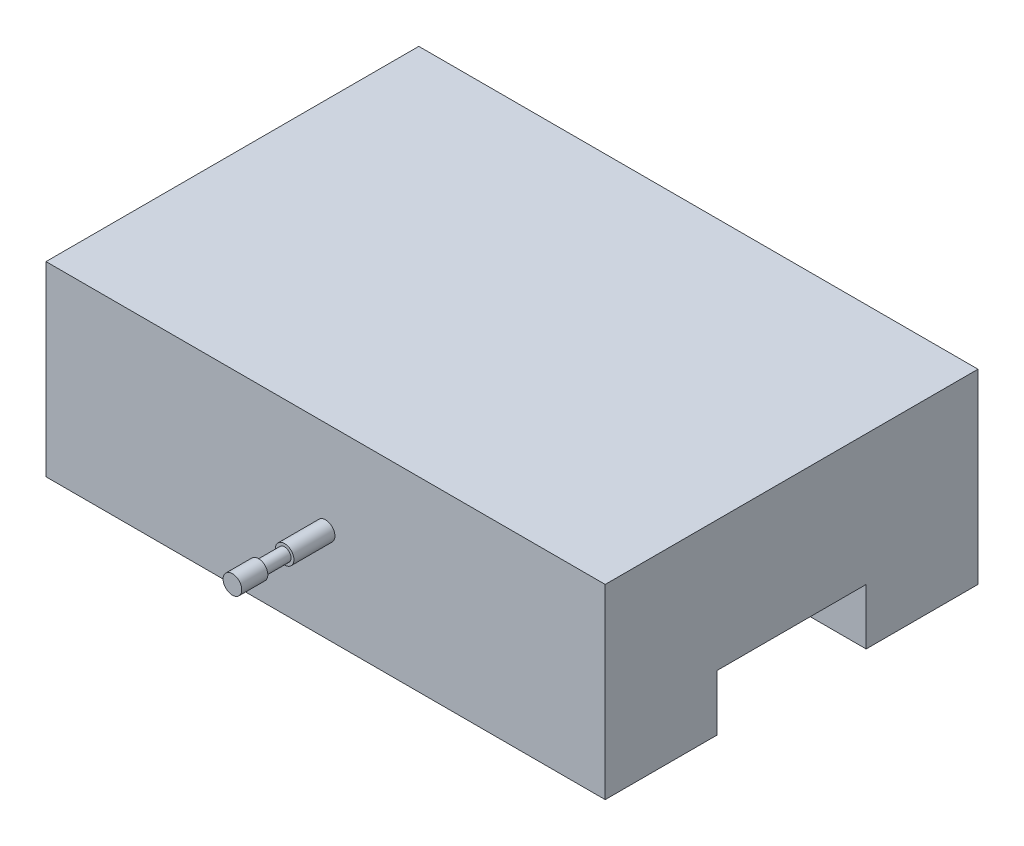
ISO-10303-21;
HEADER;
FILE_DESCRIPTION(('STEP AP214'),'2;1');
FILE_NAME('part.step','',(''),(''),'','','');
FILE_SCHEMA(('AUTOMOTIVE_DESIGN { 1 0 10303 214 1 1 1 1 }'));
ENDSEC;
DATA;
#1=APPLICATION_CONTEXT('core data for automotive mechanical design processes');
#2=APPLICATION_PROTOCOL_DEFINITION('international standard','automotive_design',2000,#1);
#3=PRODUCT_CONTEXT('',#1,'mechanical');
#4=PRODUCT('Part','Part','',(#3));
#5=PRODUCT_RELATED_PRODUCT_CATEGORY('part','',(#4));
#6=PRODUCT_DEFINITION_FORMATION('','',#4);
#7=PRODUCT_DEFINITION_CONTEXT('part definition',#1,'design');
#8=PRODUCT_DEFINITION('design','',#6,#7);
#9=PRODUCT_DEFINITION_SHAPE('','',#8);
#10=(LENGTH_UNIT() NAMED_UNIT(*) SI_UNIT(.MILLI.,.METRE.));
#11=(NAMED_UNIT(*) PLANE_ANGLE_UNIT() SI_UNIT($,.RADIAN.));
#12=(NAMED_UNIT(*) SI_UNIT($,.STERADIAN.) SOLID_ANGLE_UNIT());
#13=UNCERTAINTY_MEASURE_WITH_UNIT(LENGTH_MEASURE(1.E-05),#10,'distance_accuracy_value','');
#14=(GEOMETRIC_REPRESENTATION_CONTEXT(3) GLOBAL_UNCERTAINTY_ASSIGNED_CONTEXT((#13)) GLOBAL_UNIT_ASSIGNED_CONTEXT((#10,
#11,#12)) REPRESENTATION_CONTEXT('',''));
#15=CARTESIAN_POINT('',(0.,0.,0.));
#16=DIRECTION('',(0.,0.,1.));
#17=DIRECTION('',(1.,0.,0.));
#18=AXIS2_PLACEMENT_3D('',#15,#16,#17);
#19=CARTESIAN_POINT('',(-75.,9.99999999999998,75.));
#20=DIRECTION('',(0.,0.,-1.));
#21=DIRECTION('',(-1.,0.,0.));
#22=AXIS2_PLACEMENT_3D('',#19,#20,#21);
#23=CYLINDRICAL_SURFACE('',#22,2.50000000000001);
#24=CARTESIAN_POINT('',(-75.,9.99999999999998,50.));
#25=DIRECTION('',(0.,0.,1.));
#26=DIRECTION('',(1.,0.,0.));
#27=AXIS2_PLACEMENT_3D('',#24,#25,#26);
#28=CIRCLE('',#27,2.50000000000001);
#29=CARTESIAN_POINT('',(-72.5,9.99999999999998,50.));
#30=VERTEX_POINT('',#29);
#31=EDGE_CURVE('E205',#30,#30,#28,.T.);
#32=ORIENTED_EDGE('',*,*,#31,.T.);
#33=EDGE_LOOP('',(#32));
#34=FACE_BOUND('',#33,.T.);
#35=CARTESIAN_POINT('',(-75.,9.99999999999998,61.));
#36=DIRECTION('',(0.,0.,1.));
#37=DIRECTION('',(1.,0.,0.));
#38=AXIS2_PLACEMENT_3D('',#35,#36,#37);
#39=CIRCLE('',#38,2.50000000000001);
#40=CARTESIAN_POINT('',(-72.5,9.99999999999998,61.));
#41=VERTEX_POINT('',#40);
#42=EDGE_CURVE('E207',#41,#41,#39,.T.);
#43=ORIENTED_EDGE('',*,*,#42,.F.);
#44=EDGE_LOOP('',(#43));
#45=FACE_BOUND('',#44,.T.);
#46=ADVANCED_FACE('F37',(#34,#45),#23,.T.);
#47=CARTESIAN_POINT('',(-150.,35.,50.));
#48=DIRECTION('',(0.,0.,1.));
#49=DIRECTION('',(0.,-1.,0.));
#50=AXIS2_PLACEMENT_3D('',#47,#48,#49);
#51=PLANE('',#50);
#52=ORIENTED_EDGE('',*,*,#31,.F.);
#53=EDGE_LOOP('',(#52));
#54=FACE_BOUND('',#53,.T.);
#55=DIRECTION('',(0.,-1.,0.));
#56=VECTOR('',#55,1.);
#57=CARTESIAN_POINT('',(0.,35.,50.));
#58=LINE('',#57,#56);
#59=CARTESIAN_POINT('',(0.,35.,50.));
#60=VERTEX_POINT('',#59);
#61=CARTESIAN_POINT('',(0.,-15.,50.));
#62=VERTEX_POINT('',#61);
#63=EDGE_CURVE('E135',#60,#62,#58,.T.);
#64=ORIENTED_EDGE('',*,*,#63,.F.);
#65=DIRECTION('',(1.,0.,0.));
#66=VECTOR('',#65,1.);
#67=CARTESIAN_POINT('',(-150.,35.,50.));
#68=LINE('',#67,#66);
#69=CARTESIAN_POINT('',(-150.,35.,50.));
#70=VERTEX_POINT('',#69);
#71=EDGE_CURVE('E11',#70,#60,#68,.T.);
#72=ORIENTED_EDGE('',*,*,#71,.F.);
#73=DIRECTION('',(0.,-1.,0.));
#74=VECTOR('',#73,1.);
#75=CARTESIAN_POINT('',(-150.,35.,50.));
#76=LINE('',#75,#74);
#77=CARTESIAN_POINT('',(-150.,-15.,50.));
#78=VERTEX_POINT('',#77);
#79=EDGE_CURVE('E156',#70,#78,#76,.T.);
#80=ORIENTED_EDGE('',*,*,#79,.T.);
#81=DIRECTION('',(1.,0.,0.));
#82=VECTOR('',#81,1.);
#83=CARTESIAN_POINT('',(-150.,-15.,50.));
#84=LINE('',#83,#82);
#85=EDGE_CURVE('E41',#78,#62,#84,.T.);
#86=ORIENTED_EDGE('',*,*,#85,.T.);
#87=EDGE_LOOP('',(#64,#72,#80,#86));
#88=FACE_BOUND('',#87,.T.);
#89=ADVANCED_FACE('F39',(#54,#88),#51,.T.);
#90=CARTESIAN_POINT('',(-150.,35.,50.));
#91=DIRECTION('',(0.,1.,0.));
#92=DIRECTION('',(0.,0.,1.));
#93=AXIS2_PLACEMENT_3D('',#90,#91,#92);
#94=PLANE('',#93);
#95=DIRECTION('',(0.,0.,1.));
#96=VECTOR('',#95,1.);
#97=CARTESIAN_POINT('',(0.,35.,50.));
#98=LINE('',#97,#96);
#99=CARTESIAN_POINT('',(0.,35.,-50.));
#100=VERTEX_POINT('',#99);
#101=EDGE_CURVE('E154',#100,#60,#98,.T.);
#102=ORIENTED_EDGE('',*,*,#101,.F.);
#103=DIRECTION('',(1.,0.,0.));
#104=VECTOR('',#103,1.);
#105=CARTESIAN_POINT('',(-150.,35.,-50.));
#106=LINE('',#105,#104);
#107=CARTESIAN_POINT('',(-150.,35.,-50.));
#108=VERTEX_POINT('',#107);
#109=EDGE_CURVE('E47',#108,#100,#106,.T.);
#110=ORIENTED_EDGE('',*,*,#109,.F.);
#111=DIRECTION('',(0.,0.,1.));
#112=VECTOR('',#111,1.);
#113=CARTESIAN_POINT('',(-150.,35.,50.));
#114=LINE('',#113,#112);
#115=EDGE_CURVE('E125',#108,#70,#114,.T.);
#116=ORIENTED_EDGE('',*,*,#115,.T.);
#117=ORIENTED_EDGE('',*,*,#71,.T.);
#118=EDGE_LOOP('',(#102,#110,#116,#117));
#119=FACE_BOUND('',#118,.T.);
#120=ADVANCED_FACE('F168',(#119),#94,.T.);
#121=CARTESIAN_POINT('',(-150.,35.,-50.));
#122=DIRECTION('',(0.,0.,-1.));
#123=DIRECTION('',(0.,1.,0.));
#124=AXIS2_PLACEMENT_3D('',#121,#122,#123);
#125=PLANE('',#124);
#126=DIRECTION('',(0.,1.,0.));
#127=VECTOR('',#126,1.);
#128=CARTESIAN_POINT('',(0.,35.,-50.));
#129=LINE('',#128,#127);
#130=CARTESIAN_POINT('',(0.,-15.,-50.));
#131=VERTEX_POINT('',#130);
#132=EDGE_CURVE('E112',#131,#100,#129,.T.);
#133=ORIENTED_EDGE('',*,*,#132,.F.);
#134=DIRECTION('',(1.,0.,0.));
#135=VECTOR('',#134,1.);
#136=CARTESIAN_POINT('',(-150.,-15.,-50.));
#137=LINE('',#136,#135);
#138=CARTESIAN_POINT('',(-150.,-15.,-50.));
#139=VERTEX_POINT('',#138);
#140=EDGE_CURVE('E107',#139,#131,#137,.T.);
#141=ORIENTED_EDGE('',*,*,#140,.F.);
#142=DIRECTION('',(0.,1.,0.));
#143=VECTOR('',#142,1.);
#144=CARTESIAN_POINT('',(-150.,35.,-50.));
#145=LINE('',#144,#143);
#146=EDGE_CURVE('E110',#139,#108,#145,.T.);
#147=ORIENTED_EDGE('',*,*,#146,.T.);
#148=ORIENTED_EDGE('',*,*,#109,.T.);
#149=EDGE_LOOP('',(#133,#141,#147,#148));
#150=FACE_BOUND('',#149,.T.);
#151=ADVANCED_FACE('F109',(#150),#125,.T.);
#152=CARTESIAN_POINT('',(-150.,-15.,-20.));
#153=DIRECTION('',(0.,-1.,0.));
#154=DIRECTION('',(0.,0.,-1.));
#155=AXIS2_PLACEMENT_3D('',#152,#153,#154);
#156=PLANE('',#155);
#157=DIRECTION('',(0.,0.,-1.));
#158=VECTOR('',#157,1.);
#159=CARTESIAN_POINT('',(0.,-15.,-20.));
#160=LINE('',#159,#158);
#161=CARTESIAN_POINT('',(0.,-15.,-20.));
#162=VERTEX_POINT('',#161);
#163=EDGE_CURVE('E151',#162,#131,#160,.T.);
#164=ORIENTED_EDGE('',*,*,#163,.F.);
#165=DIRECTION('',(1.,0.,0.));
#166=VECTOR('',#165,1.);
#167=CARTESIAN_POINT('',(-150.,-15.,-20.));
#168=LINE('',#167,#166);
#169=CARTESIAN_POINT('',(-150.,-15.,-20.));
#170=VERTEX_POINT('',#169);
#171=EDGE_CURVE('E117',#170,#162,#168,.T.);
#172=ORIENTED_EDGE('',*,*,#171,.F.);
#173=DIRECTION('',(0.,0.,-1.));
#174=VECTOR('',#173,1.);
#175=CARTESIAN_POINT('',(-150.,-15.,-20.));
#176=LINE('',#175,#174);
#177=EDGE_CURVE('E123',#170,#139,#176,.T.);
#178=ORIENTED_EDGE('',*,*,#177,.T.);
#179=ORIENTED_EDGE('',*,*,#140,.T.);
#180=EDGE_LOOP('',(#164,#172,#178,#179));
#181=FACE_BOUND('',#180,.T.);
#182=ADVANCED_FACE('F127',(#181),#156,.T.);
#183=CARTESIAN_POINT('',(-150.,0.,-20.));
#184=DIRECTION('',(0.,0.,1.));
#185=DIRECTION('',(0.,-1.,0.));
#186=AXIS2_PLACEMENT_3D('',#183,#184,#185);
#187=PLANE('',#186);
#188=DIRECTION('',(0.,-1.,0.));
#189=VECTOR('',#188,1.);
#190=CARTESIAN_POINT('',(0.,0.,-20.));
#191=LINE('',#190,#189);
#192=CARTESIAN_POINT('',(0.,0.,-20.));
#193=VERTEX_POINT('',#192);
#194=EDGE_CURVE('E148',#193,#162,#191,.T.);
#195=ORIENTED_EDGE('',*,*,#194,.F.);
#196=DIRECTION('',(1.,0.,0.));
#197=VECTOR('',#196,1.);
#198=CARTESIAN_POINT('',(-150.,0.,-20.));
#199=LINE('',#198,#197);
#200=CARTESIAN_POINT('',(-150.,0.,-20.));
#201=VERTEX_POINT('',#200);
#202=EDGE_CURVE('E160',#201,#193,#199,.T.);
#203=ORIENTED_EDGE('',*,*,#202,.F.);
#204=DIRECTION('',(0.,-1.,0.));
#205=VECTOR('',#204,1.);
#206=CARTESIAN_POINT('',(-150.,0.,-20.));
#207=LINE('',#206,#205);
#208=EDGE_CURVE('E128',#201,#170,#207,.T.);
#209=ORIENTED_EDGE('',*,*,#208,.T.);
#210=ORIENTED_EDGE('',*,*,#171,.T.);
#211=EDGE_LOOP('',(#195,#203,#209,#210));
#212=FACE_BOUND('',#211,.T.);
#213=ADVANCED_FACE('F227',(#212),#187,.T.);
#214=CARTESIAN_POINT('',(-150.,0.,20.));
#215=DIRECTION('',(0.,-1.,0.));
#216=DIRECTION('',(0.,0.,-1.));
#217=AXIS2_PLACEMENT_3D('',#214,#215,#216);
#218=PLANE('',#217);
#219=DIRECTION('',(0.,0.,-1.));
#220=VECTOR('',#219,1.);
#221=CARTESIAN_POINT('',(0.,0.,20.));
#222=LINE('',#221,#220);
#223=CARTESIAN_POINT('',(0.,0.,20.));
#224=VERTEX_POINT('',#223);
#225=EDGE_CURVE('E145',#224,#193,#222,.T.);
#226=ORIENTED_EDGE('',*,*,#225,.F.);
#227=DIRECTION('',(1.,0.,0.));
#228=VECTOR('',#227,1.);
#229=CARTESIAN_POINT('',(-150.,0.,20.));
#230=LINE('',#229,#228);
#231=CARTESIAN_POINT('',(-150.,0.,20.));
#232=VERTEX_POINT('',#231);
#233=EDGE_CURVE('E162',#232,#224,#230,.T.);
#234=ORIENTED_EDGE('',*,*,#233,.F.);
#235=DIRECTION('',(0.,0.,-1.));
#236=VECTOR('',#235,1.);
#237=CARTESIAN_POINT('',(-150.,0.,20.));
#238=LINE('',#237,#236);
#239=EDGE_CURVE('E130',#232,#201,#238,.T.);
#240=ORIENTED_EDGE('',*,*,#239,.T.);
#241=ORIENTED_EDGE('',*,*,#202,.T.);
#242=EDGE_LOOP('',(#226,#234,#240,#241));
#243=FACE_BOUND('',#242,.T.);
#244=ADVANCED_FACE('F221',(#243),#218,.T.);
#245=CARTESIAN_POINT('',(-150.,-15.,20.));
#246=DIRECTION('',(0.,0.,-1.));
#247=DIRECTION('',(-1.,0.,0.));
#248=AXIS2_PLACEMENT_3D('',#245,#246,#247);
#249=PLANE('',#248);
#250=DIRECTION('',(0.,1.,0.));
#251=VECTOR('',#250,1.);
#252=CARTESIAN_POINT('',(0.,-15.,20.));
#253=LINE('',#252,#251);
#254=CARTESIAN_POINT('',(0.,-15.,20.));
#255=VERTEX_POINT('',#254);
#256=EDGE_CURVE('E142',#255,#224,#253,.T.);
#257=ORIENTED_EDGE('',*,*,#256,.F.);
#258=DIRECTION('',(1.,0.,0.));
#259=VECTOR('',#258,1.);
#260=CARTESIAN_POINT('',(-150.,-15.,20.));
#261=LINE('',#260,#259);
#262=CARTESIAN_POINT('',(-150.,-15.,20.));
#263=VERTEX_POINT('',#262);
#264=EDGE_CURVE('E163',#263,#255,#261,.T.);
#265=ORIENTED_EDGE('',*,*,#264,.F.);
#266=DIRECTION('',(0.,1.,0.));
#267=VECTOR('',#266,1.);
#268=CARTESIAN_POINT('',(-150.,-15.,20.));
#269=LINE('',#268,#267);
#270=EDGE_CURVE('E215',#263,#232,#269,.T.);
#271=ORIENTED_EDGE('',*,*,#270,.T.);
#272=ORIENTED_EDGE('',*,*,#233,.T.);
#273=EDGE_LOOP('',(#257,#265,#271,#272));
#274=FACE_BOUND('',#273,.T.);
#275=ADVANCED_FACE('F225',(#274),#249,.T.);
#276=CARTESIAN_POINT('',(-150.,-15.,50.));
#277=DIRECTION('',(0.,-1.,0.));
#278=DIRECTION('',(0.,0.,-1.));
#279=AXIS2_PLACEMENT_3D('',#276,#277,#278);
#280=PLANE('',#279);
#281=DIRECTION('',(0.,0.,-1.));
#282=VECTOR('',#281,1.);
#283=CARTESIAN_POINT('',(0.,-15.,50.));
#284=LINE('',#283,#282);
#285=EDGE_CURVE('E138',#62,#255,#284,.T.);
#286=ORIENTED_EDGE('',*,*,#285,.F.);
#287=ORIENTED_EDGE('',*,*,#85,.F.);
#288=DIRECTION('',(0.,0.,-1.));
#289=VECTOR('',#288,1.);
#290=CARTESIAN_POINT('',(-150.,-15.,50.));
#291=LINE('',#290,#289);
#292=EDGE_CURVE('E213',#78,#263,#291,.T.);
#293=ORIENTED_EDGE('',*,*,#292,.T.);
#294=ORIENTED_EDGE('',*,*,#264,.T.);
#295=EDGE_LOOP('',(#286,#287,#293,#294));
#296=FACE_BOUND('',#295,.T.);
#297=ADVANCED_FACE('F165',(#296),#280,.T.);
#298=CARTESIAN_POINT('',(-150.,0.,0.));
#299=DIRECTION('',(1.,0.,0.));
#300=DIRECTION('',(0.,0.,-1.));
#301=AXIS2_PLACEMENT_3D('',#298,#299,#300);
#302=PLANE('',#301);
#303=ORIENTED_EDGE('',*,*,#79,.F.);
#304=ORIENTED_EDGE('',*,*,#115,.F.);
#305=ORIENTED_EDGE('',*,*,#146,.F.);
#306=ORIENTED_EDGE('',*,*,#177,.F.);
#307=ORIENTED_EDGE('',*,*,#208,.F.);
#308=ORIENTED_EDGE('',*,*,#239,.F.);
#309=ORIENTED_EDGE('',*,*,#270,.F.);
#310=ORIENTED_EDGE('',*,*,#292,.F.);
#311=EDGE_LOOP('',(#303,#304,#305,#306,#307,#308,#309,#310));
#312=FACE_BOUND('',#311,.T.);
#313=ADVANCED_FACE('F121',(#312),#302,.F.);
#314=CARTESIAN_POINT('',(0.,0.,0.));
#315=DIRECTION('',(1.,0.,0.));
#316=DIRECTION('',(0.,0.,-1.));
#317=AXIS2_PLACEMENT_3D('',#314,#315,#316);
#318=PLANE('',#317);
#319=ORIENTED_EDGE('',*,*,#63,.T.);
#320=ORIENTED_EDGE('',*,*,#285,.T.);
#321=ORIENTED_EDGE('',*,*,#256,.T.);
#322=ORIENTED_EDGE('',*,*,#225,.T.);
#323=ORIENTED_EDGE('',*,*,#194,.T.);
#324=ORIENTED_EDGE('',*,*,#163,.T.);
#325=ORIENTED_EDGE('',*,*,#132,.T.);
#326=ORIENTED_EDGE('',*,*,#101,.T.);
#327=EDGE_LOOP('',(#319,#320,#321,#322,#323,#324,#325,#326));
#328=FACE_BOUND('',#327,.T.);
#329=ADVANCED_FACE('F167',(#328),#318,.T.);
#330=CARTESIAN_POINT('',(-75.,9.99999999999998,61.));
#331=DIRECTION('',(0.,0.,1.));
#332=DIRECTION('',(1.,0.,0.));
#333=AXIS2_PLACEMENT_3D('',#330,#331,#332);
#334=PLANE('',#333);
#335=CARTESIAN_POINT('',(-75.,9.99999999999998,61.));
#336=DIRECTION('',(0.,0.,1.));
#337=DIRECTION('',(1.,0.,0.));
#338=AXIS2_PLACEMENT_3D('',#335,#336,#337);
#339=CIRCLE('',#338,1.73391068690876);
#340=CARTESIAN_POINT('',(-73.2660893130912,9.99999999999998,61.));
#341=VERTEX_POINT('',#340);
#342=EDGE_CURVE('E264',#341,#341,#339,.T.);
#343=ORIENTED_EDGE('',*,*,#342,.F.);
#344=EDGE_LOOP('',(#343));
#345=FACE_BOUND('',#344,.T.);
#346=ORIENTED_EDGE('',*,*,#42,.T.);
#347=EDGE_LOOP('',(#346));
#348=FACE_BOUND('',#347,.T.);
#349=ADVANCED_FACE('F244',(#345,#348),#334,.T.);
#350=CARTESIAN_POINT('',(-75.,9.99999999999998,68.));
#351=DIRECTION('',(0.,0.,1.));
#352=DIRECTION('',(1.,0.,0.));
#353=AXIS2_PLACEMENT_3D('',#350,#351,#352);
#354=PLANE('',#353);
#355=CARTESIAN_POINT('',(-75.,9.99999999999998,68.));
#356=DIRECTION('',(0.,0.,1.));
#357=DIRECTION('',(1.,0.,0.));
#358=AXIS2_PLACEMENT_3D('',#355,#356,#357);
#359=CIRCLE('',#358,1.73391068690876);
#360=CARTESIAN_POINT('',(-73.2660893130912,9.99999999999998,68.));
#361=VERTEX_POINT('',#360);
#362=EDGE_CURVE('E267',#361,#361,#359,.T.);
#363=ORIENTED_EDGE('',*,*,#362,.T.);
#364=EDGE_LOOP('',(#363));
#365=FACE_BOUND('',#364,.T.);
#366=CARTESIAN_POINT('',(-75.,9.99999999999998,68.));
#367=DIRECTION('',(0.,0.,1.));
#368=DIRECTION('',(1.,0.,0.));
#369=AXIS2_PLACEMENT_3D('',#366,#367,#368);
#370=CIRCLE('',#369,2.50000000000001);
#371=CARTESIAN_POINT('',(-72.5,9.99999999999998,68.));
#372=VERTEX_POINT('',#371);
#373=EDGE_CURVE('E202',#372,#372,#370,.T.);
#374=ORIENTED_EDGE('',*,*,#373,.F.);
#375=EDGE_LOOP('',(#374));
#376=FACE_BOUND('',#375,.T.);
#377=ADVANCED_FACE('F247',(#365,#376),#354,.F.);
#378=CARTESIAN_POINT('',(-75.,9.99999999999998,61.));
#379=DIRECTION('',(0.,0.,1.));
#380=DIRECTION('',(1.,0.,0.));
#381=AXIS2_PLACEMENT_3D('',#378,#379,#380);
#382=CYLINDRICAL_SURFACE('',#381,1.73391068690876);
#383=ORIENTED_EDGE('',*,*,#342,.T.);
#384=EDGE_LOOP('',(#383));
#385=FACE_BOUND('',#384,.T.);
#386=ORIENTED_EDGE('',*,*,#362,.F.);
#387=EDGE_LOOP('',(#386));
#388=FACE_BOUND('',#387,.T.);
#389=ADVANCED_FACE('F197',(#385,#388),#382,.T.);
#390=CARTESIAN_POINT('',(-75.,9.99999999999998,75.));
#391=DIRECTION('',(0.,0.,1.));
#392=DIRECTION('',(1.,0.,0.));
#393=AXIS2_PLACEMENT_3D('',#390,#391,#392);
#394=PLANE('',#393);
#395=CARTESIAN_POINT('',(-75.,9.99999999999998,75.));
#396=DIRECTION('',(0.,0.,1.));
#397=DIRECTION('',(1.,0.,0.));
#398=AXIS2_PLACEMENT_3D('',#395,#396,#397);
#399=CIRCLE('',#398,2.50000000000001);
#400=CARTESIAN_POINT('',(-72.5,9.99999999999998,75.));
#401=VERTEX_POINT('',#400);
#402=EDGE_CURVE('E139',#401,#401,#399,.T.);
#403=ORIENTED_EDGE('',*,*,#402,.T.);
#404=EDGE_LOOP('',(#403));
#405=FACE_BOUND('',#404,.T.);
#406=ADVANCED_FACE('F192',(#405),#394,.T.);
#407=ORIENTED_EDGE('',*,*,#373,.T.);
#408=EDGE_LOOP('',(#407));
#409=FACE_BOUND('',#408,.T.);
#410=ORIENTED_EDGE('',*,*,#402,.F.);
#411=EDGE_LOOP('',(#410));
#412=FACE_BOUND('',#411,.T.);
#413=ADVANCED_FACE('F182',(#409,#412),#23,.T.);
#414=CLOSED_SHELL('',(#46,#89,#120,#151,#182,#213,#244,#275,#297,#313,#329,#349,#377,#389,#406,#413));
#415=MANIFOLD_SOLID_BREP('B2',#414);
#416=ADVANCED_BREP_SHAPE_REPRESENTATION('',(#18,#415),#14);
#417=SHAPE_DEFINITION_REPRESENTATION(#9,#416);
ENDSEC;
END-ISO-10303-21;
